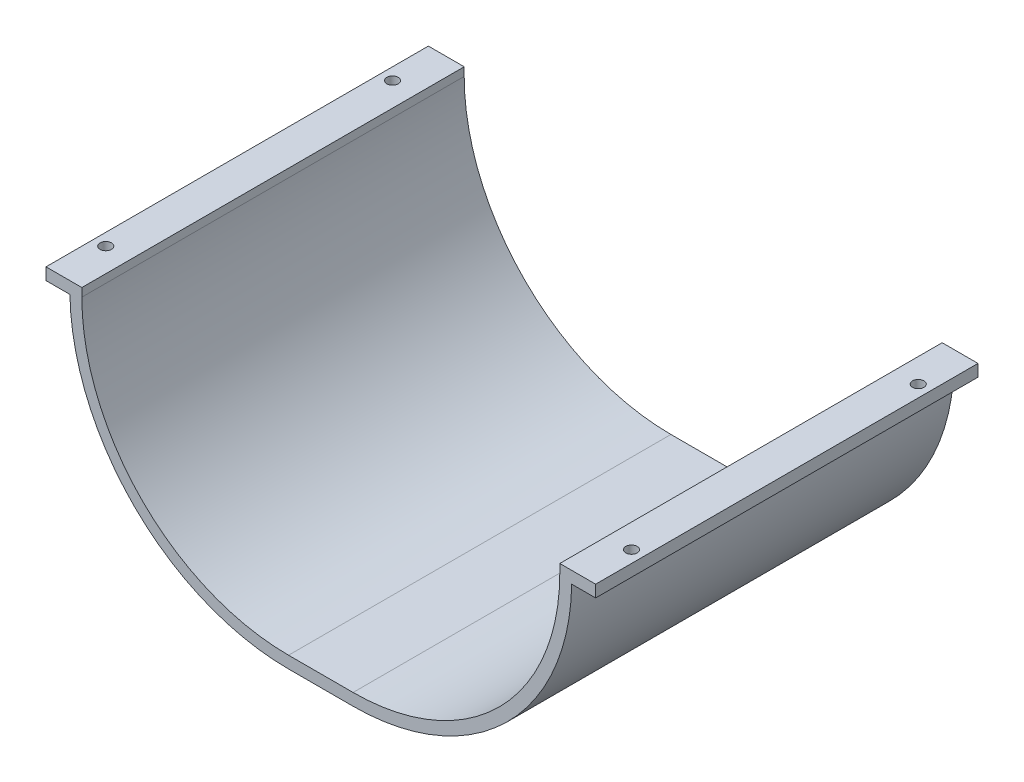
ISO-10303-21;
HEADER;
FILE_DESCRIPTION(('STEP AP214'),'2;1');
FILE_NAME('part.step','',(''),(''),'','','');
FILE_SCHEMA(('AUTOMOTIVE_DESIGN { 1 0 10303 214 1 1 1 1 }'));
ENDSEC;
DATA;
#1=APPLICATION_CONTEXT('core data for automotive mechanical design processes');
#2=APPLICATION_PROTOCOL_DEFINITION('international standard','automotive_design',2000,#1);
#3=PRODUCT_CONTEXT('',#1,'mechanical');
#4=PRODUCT('Part','Part','',(#3));
#5=PRODUCT_RELATED_PRODUCT_CATEGORY('part','',(#4));
#6=PRODUCT_DEFINITION_FORMATION('','',#4);
#7=PRODUCT_DEFINITION_CONTEXT('part definition',#1,'design');
#8=PRODUCT_DEFINITION('design','',#6,#7);
#9=PRODUCT_DEFINITION_SHAPE('','',#8);
#10=(LENGTH_UNIT() NAMED_UNIT(*) SI_UNIT(.MILLI.,.METRE.));
#11=(NAMED_UNIT(*) PLANE_ANGLE_UNIT() SI_UNIT($,.RADIAN.));
#12=(NAMED_UNIT(*) SI_UNIT($,.STERADIAN.) SOLID_ANGLE_UNIT());
#13=UNCERTAINTY_MEASURE_WITH_UNIT(LENGTH_MEASURE(1.E-05),#10,'distance_accuracy_value','');
#14=(GEOMETRIC_REPRESENTATION_CONTEXT(3) GLOBAL_UNCERTAINTY_ASSIGNED_CONTEXT((#13)) GLOBAL_UNIT_ASSIGNED_CONTEXT((#10,
#11,#12)) REPRESENTATION_CONTEXT('',''));
#15=CARTESIAN_POINT('',(0.,0.,0.));
#16=DIRECTION('',(0.,0.,1.));
#17=DIRECTION('',(1.,0.,0.));
#18=AXIS2_PLACEMENT_3D('',#15,#16,#17);
#19=CARTESIAN_POINT('',(86.5,86.5,160.));
#20=DIRECTION('',(0.,0.,-1.));
#21=DIRECTION('',(-1.,0.,0.));
#22=AXIS2_PLACEMENT_3D('',#19,#20,#21);
#23=CYLINDRICAL_SURFACE('',#22,91.5);
#24=CARTESIAN_POINT('',(86.5,86.5,0.));
#25=DIRECTION('',(0.,0.,1.));
#26=DIRECTION('',(1.,0.,0.));
#27=AXIS2_PLACEMENT_3D('',#24,#25,#26);
#28=CIRCLE('',#27,91.5);
#29=CARTESIAN_POINT('',(86.5000000000006,-4.99999999999999,0.));
#30=VERTEX_POINT('',#29);
#31=CARTESIAN_POINT('',(-4.98770409186144,85.,0.));
#32=VERTEX_POINT('',#31);
#33=EDGE_CURVE('E226',#30,#32,#28,.F.);
#34=ORIENTED_EDGE('',*,*,#33,.F.);
#35=DIRECTION('',(0.,0.,-1.));
#36=VECTOR('',#35,1.);
#37=CARTESIAN_POINT('',(86.5000000000006,-4.99999999999999,160.));
#38=LINE('',#37,#36);
#39=CARTESIAN_POINT('',(86.5000000000006,-4.99999999999999,160.));
#40=VERTEX_POINT('',#39);
#41=EDGE_CURVE('E11',#40,#30,#38,.T.);
#42=ORIENTED_EDGE('',*,*,#41,.F.);
#43=CARTESIAN_POINT('',(86.5,86.5,160.));
#44=DIRECTION('',(0.,0.,1.));
#45=DIRECTION('',(1.,0.,0.));
#46=AXIS2_PLACEMENT_3D('',#43,#44,#45);
#47=CIRCLE('',#46,91.5);
#48=CARTESIAN_POINT('',(-4.98770409186144,85.,160.));
#49=VERTEX_POINT('',#48);
#50=EDGE_CURVE('E190',#40,#49,#47,.F.);
#51=ORIENTED_EDGE('',*,*,#50,.T.);
#52=DIRECTION('',(0.,0.,-1.));
#53=VECTOR('',#52,1.);
#54=CARTESIAN_POINT('',(-4.98770409186144,85.,160.));
#55=LINE('',#54,#53);
#56=EDGE_CURVE('E110',#49,#32,#55,.T.);
#57=ORIENTED_EDGE('',*,*,#56,.T.);
#58=EDGE_LOOP('',(#34,#42,#51,#57));
#59=FACE_BOUND('',#58,.T.);
#60=ADVANCED_FACE('F40',(#59),#23,.T.);
#61=CARTESIAN_POINT('',(0.,-5.00000000000001,160.));
#62=DIRECTION('',(0.,1.,0.));
#63=DIRECTION('',(-1.,0.,0.));
#64=AXIS2_PLACEMENT_3D('',#61,#62,#63);
#65=PLANE('',#64);
#66=DIRECTION('',(1.,0.,0.));
#67=VECTOR('',#66,1.);
#68=CARTESIAN_POINT('',(0.,-5.00000000000001,0.));
#69=LINE('',#68,#67);
#70=CARTESIAN_POINT('',(113.499999999999,-4.99999999999999,0.));
#71=VERTEX_POINT('',#70);
#72=EDGE_CURVE('E229',#30,#71,#69,.T.);
#73=ORIENTED_EDGE('',*,*,#72,.T.);
#74=DIRECTION('',(0.,0.,-1.));
#75=VECTOR('',#74,1.);
#76=CARTESIAN_POINT('',(113.499999999999,-4.99999999999999,160.));
#77=LINE('',#76,#75);
#78=CARTESIAN_POINT('',(113.499999999999,-4.99999999999999,160.));
#79=VERTEX_POINT('',#78);
#80=EDGE_CURVE('E49',#79,#71,#77,.T.);
#81=ORIENTED_EDGE('',*,*,#80,.F.);
#82=DIRECTION('',(1.,0.,0.));
#83=VECTOR('',#82,1.);
#84=CARTESIAN_POINT('',(0.,-5.00000000000001,160.));
#85=LINE('',#84,#83);
#86=EDGE_CURVE('E188',#40,#79,#85,.T.);
#87=ORIENTED_EDGE('',*,*,#86,.F.);
#88=ORIENTED_EDGE('',*,*,#41,.T.);
#89=EDGE_LOOP('',(#73,#81,#87,#88));
#90=FACE_BOUND('',#89,.T.);
#91=ADVANCED_FACE('F331',(#90),#65,.F.);
#92=CARTESIAN_POINT('',(113.5,86.5,160.));
#93=DIRECTION('',(0.,0.,-1.));
#94=DIRECTION('',(-1.,0.,0.));
#95=AXIS2_PLACEMENT_3D('',#92,#93,#94);
#96=CYLINDRICAL_SURFACE('',#95,91.5);
#97=CARTESIAN_POINT('',(113.5,86.5,0.));
#98=DIRECTION('',(0.,0.,1.));
#99=DIRECTION('',(1.,0.,0.));
#100=AXIS2_PLACEMENT_3D('',#97,#98,#99);
#101=CIRCLE('',#100,91.5);
#102=CARTESIAN_POINT('',(204.987704091861,85.,0.));
#103=VERTEX_POINT('',#102);
#104=EDGE_CURVE('E231',#71,#103,#101,.T.);
#105=ORIENTED_EDGE('',*,*,#104,.T.);
#106=DIRECTION('',(0.,0.,-1.));
#107=VECTOR('',#106,1.);
#108=CARTESIAN_POINT('',(204.987704091861,85.,160.));
#109=LINE('',#108,#107);
#110=CARTESIAN_POINT('',(204.987704091861,85.,160.));
#111=VERTEX_POINT('',#110);
#112=EDGE_CURVE('E280',#111,#103,#109,.T.);
#113=ORIENTED_EDGE('',*,*,#112,.F.);
#114=CARTESIAN_POINT('',(113.5,86.5,160.));
#115=DIRECTION('',(0.,0.,1.));
#116=DIRECTION('',(1.,0.,0.));
#117=AXIS2_PLACEMENT_3D('',#114,#115,#116);
#118=CIRCLE('',#117,91.5);
#119=EDGE_CURVE('E184',#79,#111,#118,.T.);
#120=ORIENTED_EDGE('',*,*,#119,.F.);
#121=ORIENTED_EDGE('',*,*,#80,.T.);
#122=EDGE_LOOP('',(#105,#113,#120,#121));
#123=FACE_BOUND('',#122,.T.);
#124=ADVANCED_FACE('F335',(#123),#96,.T.);
#125=CARTESIAN_POINT('',(0.,85.,160.));
#126=DIRECTION('',(0.,-1.,0.));
#127=DIRECTION('',(0.,0.,-1.));
#128=AXIS2_PLACEMENT_3D('',#125,#126,#127);
#129=PLANE('',#128);
#130=CARTESIAN_POINT('',(209.993852045931,85.,140.));
#131=DIRECTION('',(0.,-1.,0.));
#132=DIRECTION('',(0.,0.,-1.));
#133=AXIS2_PLACEMENT_3D('',#130,#131,#132);
#134=CIRCLE('',#133,2.38125);
#135=CARTESIAN_POINT('',(209.993852045931,85.,137.61875));
#136=VERTEX_POINT('',#135);
#137=EDGE_CURVE('E204',#136,#136,#134,.T.);
#138=ORIENTED_EDGE('',*,*,#137,.F.);
#139=EDGE_LOOP('',(#138));
#140=FACE_BOUND('',#139,.T.);
#141=CARTESIAN_POINT('',(209.993852045931,85.,20.));
#142=DIRECTION('',(0.,-1.,0.));
#143=DIRECTION('',(0.,0.,-1.));
#144=AXIS2_PLACEMENT_3D('',#141,#142,#143);
#145=CIRCLE('',#144,2.38125000000001);
#146=CARTESIAN_POINT('',(209.993852045931,85.,17.61875));
#147=VERTEX_POINT('',#146);
#148=EDGE_CURVE('E207',#147,#147,#145,.T.);
#149=ORIENTED_EDGE('',*,*,#148,.F.);
#150=EDGE_LOOP('',(#149));
#151=FACE_BOUND('',#150,.T.);
#152=DIRECTION('',(-1.,0.,0.));
#153=VECTOR('',#152,1.);
#154=CARTESIAN_POINT('',(0.,85.,0.));
#155=LINE('',#154,#153);
#156=CARTESIAN_POINT('',(215.,85.,0.));
#157=VERTEX_POINT('',#156);
#158=EDGE_CURVE('E238',#157,#103,#155,.T.);
#159=ORIENTED_EDGE('',*,*,#158,.F.);
#160=DIRECTION('',(0.,0.,-1.));
#161=VECTOR('',#160,1.);
#162=CARTESIAN_POINT('',(215.,85.,160.));
#163=LINE('',#162,#161);
#164=CARTESIAN_POINT('',(215.,85.,160.));
#165=VERTEX_POINT('',#164);
#166=EDGE_CURVE('E278',#165,#157,#163,.T.);
#167=ORIENTED_EDGE('',*,*,#166,.F.);
#168=DIRECTION('',(-1.,0.,0.));
#169=VECTOR('',#168,1.);
#170=CARTESIAN_POINT('',(0.,85.,160.));
#171=LINE('',#170,#169);
#172=EDGE_CURVE('E180',#165,#111,#171,.T.);
#173=ORIENTED_EDGE('',*,*,#172,.T.);
#174=ORIENTED_EDGE('',*,*,#112,.T.);
#175=EDGE_LOOP('',(#159,#167,#173,#174));
#176=FACE_BOUND('',#175,.T.);
#177=ADVANCED_FACE('F340',(#140,#151,#176),#129,.T.);
#178=CARTESIAN_POINT('',(215.,0.,160.));
#179=DIRECTION('',(1.,0.,0.));
#180=DIRECTION('',(0.,0.,-1.));
#181=AXIS2_PLACEMENT_3D('',#178,#179,#180);
#182=PLANE('',#181);
#183=DIRECTION('',(0.,-1.,0.));
#184=VECTOR('',#183,1.);
#185=CARTESIAN_POINT('',(215.,0.,0.));
#186=LINE('',#185,#184);
#187=CARTESIAN_POINT('',(215.,90.,0.));
#188=VERTEX_POINT('',#187);
#189=EDGE_CURVE('E241',#188,#157,#186,.T.);
#190=ORIENTED_EDGE('',*,*,#189,.F.);
#191=DIRECTION('',(0.,0.,-1.));
#192=VECTOR('',#191,1.);
#193=CARTESIAN_POINT('',(215.,90.,160.));
#194=LINE('',#193,#192);
#195=CARTESIAN_POINT('',(215.,90.,160.));
#196=VERTEX_POINT('',#195);
#197=EDGE_CURVE('E276',#196,#188,#194,.T.);
#198=ORIENTED_EDGE('',*,*,#197,.F.);
#199=DIRECTION('',(0.,-1.,0.));
#200=VECTOR('',#199,1.);
#201=CARTESIAN_POINT('',(215.,0.,160.));
#202=LINE('',#201,#200);
#203=EDGE_CURVE('E174',#196,#165,#202,.T.);
#204=ORIENTED_EDGE('',*,*,#203,.T.);
#205=ORIENTED_EDGE('',*,*,#166,.T.);
#206=EDGE_LOOP('',(#190,#198,#204,#205));
#207=FACE_BOUND('',#206,.T.);
#208=ADVANCED_FACE('F292',(#207),#182,.T.);
#209=CARTESIAN_POINT('',(0.,90.,160.));
#210=DIRECTION('',(0.,1.,0.));
#211=DIRECTION('',(0.,0.,1.));
#212=AXIS2_PLACEMENT_3D('',#209,#210,#211);
#213=PLANE('',#212);
#214=CARTESIAN_POINT('',(209.993852045931,90.,140.));
#215=DIRECTION('',(0.,1.,0.));
#216=DIRECTION('',(0.,0.,1.));
#217=AXIS2_PLACEMENT_3D('',#214,#215,#216);
#218=CIRCLE('',#217,2.38125);
#219=CARTESIAN_POINT('',(209.993852045931,90.,142.38125));
#220=VERTEX_POINT('',#219);
#221=EDGE_CURVE('E43',#220,#220,#218,.T.);
#222=ORIENTED_EDGE('',*,*,#221,.F.);
#223=EDGE_LOOP('',(#222));
#224=FACE_BOUND('',#223,.T.);
#225=CARTESIAN_POINT('',(209.993852045931,90.,20.));
#226=DIRECTION('',(0.,1.,0.));
#227=DIRECTION('',(0.,0.,1.));
#228=AXIS2_PLACEMENT_3D('',#225,#226,#227);
#229=CIRCLE('',#228,2.38125000000001);
#230=CARTESIAN_POINT('',(209.993852045931,90.,22.38125));
#231=VERTEX_POINT('',#230);
#232=EDGE_CURVE('E196',#231,#231,#229,.T.);
#233=ORIENTED_EDGE('',*,*,#232,.F.);
#234=EDGE_LOOP('',(#233));
#235=FACE_BOUND('',#234,.T.);
#236=DIRECTION('',(1.,0.,0.));
#237=VECTOR('',#236,1.);
#238=CARTESIAN_POINT('',(0.,90.,0.));
#239=LINE('',#238,#237);
#240=CARTESIAN_POINT('',(200.,90.,0.));
#241=VERTEX_POINT('',#240);
#242=EDGE_CURVE('E244',#241,#188,#239,.T.);
#243=ORIENTED_EDGE('',*,*,#242,.F.);
#244=DIRECTION('',(0.,0.,-1.));
#245=VECTOR('',#244,1.);
#246=CARTESIAN_POINT('',(200.,90.,160.));
#247=LINE('',#246,#245);
#248=CARTESIAN_POINT('',(200.,90.,160.));
#249=VERTEX_POINT('',#248);
#250=EDGE_CURVE('E274',#249,#241,#247,.T.);
#251=ORIENTED_EDGE('',*,*,#250,.F.);
#252=DIRECTION('',(1.,0.,0.));
#253=VECTOR('',#252,1.);
#254=CARTESIAN_POINT('',(0.,90.,160.));
#255=LINE('',#254,#253);
#256=EDGE_CURVE('E167',#249,#196,#255,.T.);
#257=ORIENTED_EDGE('',*,*,#256,.T.);
#258=ORIENTED_EDGE('',*,*,#197,.T.);
#259=EDGE_LOOP('',(#243,#251,#257,#258));
#260=FACE_BOUND('',#259,.T.);
#261=ADVANCED_FACE('F289',(#224,#235,#260),#213,.T.);
#262=CARTESIAN_POINT('',(200.,0.,160.));
#263=DIRECTION('',(-1.,0.,0.));
#264=DIRECTION('',(0.,0.,1.));
#265=AXIS2_PLACEMENT_3D('',#262,#263,#264);
#266=PLANE('',#265);
#267=DIRECTION('',(0.,1.,0.));
#268=VECTOR('',#267,1.);
#269=CARTESIAN_POINT('',(200.,0.,0.));
#270=LINE('',#269,#268);
#271=CARTESIAN_POINT('',(200.,86.5000000000006,0.));
#272=VERTEX_POINT('',#271);
#273=EDGE_CURVE('E247',#272,#241,#270,.T.);
#274=ORIENTED_EDGE('',*,*,#273,.F.);
#275=DIRECTION('',(0.,0.,-1.));
#276=VECTOR('',#275,1.);
#277=CARTESIAN_POINT('',(200.,86.5000000000006,160.));
#278=LINE('',#277,#276);
#279=CARTESIAN_POINT('',(200.,86.5000000000006,160.));
#280=VERTEX_POINT('',#279);
#281=EDGE_CURVE('E272',#280,#272,#278,.T.);
#282=ORIENTED_EDGE('',*,*,#281,.F.);
#283=DIRECTION('',(0.,1.,0.));
#284=VECTOR('',#283,1.);
#285=CARTESIAN_POINT('',(200.,0.,160.));
#286=LINE('',#285,#284);
#287=EDGE_CURVE('E173',#280,#249,#286,.T.);
#288=ORIENTED_EDGE('',*,*,#287,.T.);
#289=ORIENTED_EDGE('',*,*,#250,.T.);
#290=EDGE_LOOP('',(#274,#282,#288,#289));
#291=FACE_BOUND('',#290,.T.);
#292=ADVANCED_FACE('F291',(#291),#266,.T.);
#293=CARTESIAN_POINT('',(113.5,86.5,160.));
#294=DIRECTION('',(0.,0.,-1.));
#295=DIRECTION('',(-1.,0.,0.));
#296=AXIS2_PLACEMENT_3D('',#293,#294,#295);
#297=CYLINDRICAL_SURFACE('',#296,86.5);
#298=CARTESIAN_POINT('',(113.5,86.5,0.));
#299=DIRECTION('',(0.,0.,1.));
#300=DIRECTION('',(1.,0.,0.));
#301=AXIS2_PLACEMENT_3D('',#298,#299,#300);
#302=CIRCLE('',#301,86.5);
#303=CARTESIAN_POINT('',(113.499999999999,0.,0.));
#304=VERTEX_POINT('',#303);
#305=EDGE_CURVE('E250',#304,#272,#302,.T.);
#306=ORIENTED_EDGE('',*,*,#305,.F.);
#307=DIRECTION('',(0.,0.,-1.));
#308=VECTOR('',#307,1.);
#309=CARTESIAN_POINT('',(113.499999999999,0.,160.));
#310=LINE('',#309,#308);
#311=CARTESIAN_POINT('',(113.499999999999,0.,160.));
#312=VERTEX_POINT('',#311);
#313=EDGE_CURVE('E270',#312,#304,#310,.T.);
#314=ORIENTED_EDGE('',*,*,#313,.F.);
#315=CARTESIAN_POINT('',(113.5,86.5,160.));
#316=DIRECTION('',(0.,0.,1.));
#317=DIRECTION('',(1.,0.,0.));
#318=AXIS2_PLACEMENT_3D('',#315,#316,#317);
#319=CIRCLE('',#318,86.5);
#320=EDGE_CURVE('E178',#312,#280,#319,.T.);
#321=ORIENTED_EDGE('',*,*,#320,.T.);
#322=ORIENTED_EDGE('',*,*,#281,.T.);
#323=EDGE_LOOP('',(#306,#314,#321,#322));
#324=FACE_BOUND('',#323,.T.);
#325=ADVANCED_FACE('F306',(#324),#297,.F.);
#326=CARTESIAN_POINT('',(0.,0.,160.));
#327=DIRECTION('',(0.,1.,0.));
#328=DIRECTION('',(-1.,0.,0.));
#329=AXIS2_PLACEMENT_3D('',#326,#327,#328);
#330=PLANE('',#329);
#331=DIRECTION('',(1.,0.,0.));
#332=VECTOR('',#331,1.);
#333=CARTESIAN_POINT('',(0.,0.,0.));
#334=LINE('',#333,#332);
#335=CARTESIAN_POINT('',(86.5000000000006,0.,0.));
#336=VERTEX_POINT('',#335);
#337=EDGE_CURVE('E253',#336,#304,#334,.T.);
#338=ORIENTED_EDGE('',*,*,#337,.F.);
#339=DIRECTION('',(0.,0.,-1.));
#340=VECTOR('',#339,1.);
#341=CARTESIAN_POINT('',(86.5000000000006,0.,160.));
#342=LINE('',#341,#340);
#343=CARTESIAN_POINT('',(86.5000000000006,0.,160.));
#344=VERTEX_POINT('',#343);
#345=EDGE_CURVE('E268',#344,#336,#342,.T.);
#346=ORIENTED_EDGE('',*,*,#345,.F.);
#347=DIRECTION('',(1.,0.,0.));
#348=VECTOR('',#347,1.);
#349=CARTESIAN_POINT('',(0.,0.,160.));
#350=LINE('',#349,#348);
#351=EDGE_CURVE('E307',#344,#312,#350,.T.);
#352=ORIENTED_EDGE('',*,*,#351,.T.);
#353=ORIENTED_EDGE('',*,*,#313,.T.);
#354=EDGE_LOOP('',(#338,#346,#352,#353));
#355=FACE_BOUND('',#354,.T.);
#356=ADVANCED_FACE('F321',(#355),#330,.T.);
#357=CARTESIAN_POINT('',(86.5,86.5,160.));
#358=DIRECTION('',(0.,0.,-1.));
#359=DIRECTION('',(-1.,0.,0.));
#360=AXIS2_PLACEMENT_3D('',#357,#358,#359);
#361=CYLINDRICAL_SURFACE('',#360,86.5);
#362=CARTESIAN_POINT('',(86.5,86.5,0.));
#363=DIRECTION('',(0.,0.,1.));
#364=DIRECTION('',(1.,0.,0.));
#365=AXIS2_PLACEMENT_3D('',#362,#363,#364);
#366=CIRCLE('',#365,86.5);
#367=CARTESIAN_POINT('',(0.,86.5000000000006,0.));
#368=VERTEX_POINT('',#367);
#369=EDGE_CURVE('E256',#336,#368,#366,.F.);
#370=ORIENTED_EDGE('',*,*,#369,.T.);
#371=DIRECTION('',(0.,0.,-1.));
#372=VECTOR('',#371,1.);
#373=CARTESIAN_POINT('',(0.,86.5000000000006,160.));
#374=LINE('',#373,#372);
#375=CARTESIAN_POINT('',(0.,86.5000000000006,160.));
#376=VERTEX_POINT('',#375);
#377=EDGE_CURVE('E265',#376,#368,#374,.T.);
#378=ORIENTED_EDGE('',*,*,#377,.F.);
#379=CARTESIAN_POINT('',(86.5,86.5,160.));
#380=DIRECTION('',(0.,0.,1.));
#381=DIRECTION('',(1.,0.,0.));
#382=AXIS2_PLACEMENT_3D('',#379,#380,#381);
#383=CIRCLE('',#382,86.5);
#384=EDGE_CURVE('E168',#344,#376,#383,.F.);
#385=ORIENTED_EDGE('',*,*,#384,.F.);
#386=ORIENTED_EDGE('',*,*,#345,.T.);
#387=EDGE_LOOP('',(#370,#378,#385,#386));
#388=FACE_BOUND('',#387,.T.);
#389=ADVANCED_FACE('F314',(#388),#361,.F.);
#390=CARTESIAN_POINT('',(0.,0.,160.));
#391=DIRECTION('',(-1.,0.,0.));
#392=DIRECTION('',(0.,0.,1.));
#393=AXIS2_PLACEMENT_3D('',#390,#391,#392);
#394=PLANE('',#393);
#395=DIRECTION('',(0.,1.,0.));
#396=VECTOR('',#395,1.);
#397=CARTESIAN_POINT('',(0.,0.,0.));
#398=LINE('',#397,#396);
#399=CARTESIAN_POINT('',(0.,90.,0.));
#400=VERTEX_POINT('',#399);
#401=EDGE_CURVE('E258',#368,#400,#398,.T.);
#402=ORIENTED_EDGE('',*,*,#401,.T.);
#403=DIRECTION('',(0.,0.,-1.));
#404=VECTOR('',#403,1.);
#405=CARTESIAN_POINT('',(0.,90.,160.));
#406=LINE('',#405,#404);
#407=CARTESIAN_POINT('',(0.,90.,160.));
#408=VERTEX_POINT('',#407);
#409=EDGE_CURVE('E156',#408,#400,#406,.T.);
#410=ORIENTED_EDGE('',*,*,#409,.F.);
#411=DIRECTION('',(0.,1.,0.));
#412=VECTOR('',#411,1.);
#413=CARTESIAN_POINT('',(0.,0.,160.));
#414=LINE('',#413,#412);
#415=EDGE_CURVE('E164',#376,#408,#414,.T.);
#416=ORIENTED_EDGE('',*,*,#415,.F.);
#417=ORIENTED_EDGE('',*,*,#377,.T.);
#418=EDGE_LOOP('',(#402,#410,#416,#417));
#419=FACE_BOUND('',#418,.T.);
#420=ADVANCED_FACE('F318',(#419),#394,.F.);
#421=CARTESIAN_POINT('',(-9.99385204593072,90.,20.));
#422=DIRECTION('',(0.,1.,0.));
#423=DIRECTION('',(0.,0.,1.));
#424=AXIS2_PLACEMENT_3D('',#421,#422,#423);
#425=CIRCLE('',#424,2.38125);
#426=CARTESIAN_POINT('',(-9.99385204593072,90.,22.38125));
#427=VERTEX_POINT('',#426);
#428=EDGE_CURVE('E193',#427,#427,#425,.T.);
#429=ORIENTED_EDGE('',*,*,#428,.F.);
#430=EDGE_LOOP('',(#429));
#431=FACE_BOUND('',#430,.T.);
#432=CARTESIAN_POINT('',(-9.99385204593072,90.,140.));
#433=DIRECTION('',(0.,1.,0.));
#434=DIRECTION('',(0.,0.,1.));
#435=AXIS2_PLACEMENT_3D('',#432,#433,#434);
#436=CIRCLE('',#435,2.38125);
#437=CARTESIAN_POINT('',(-9.99385204593072,90.,142.38125));
#438=VERTEX_POINT('',#437);
#439=EDGE_CURVE('E197',#438,#438,#436,.T.);
#440=ORIENTED_EDGE('',*,*,#439,.F.);
#441=EDGE_LOOP('',(#440));
#442=FACE_BOUND('',#441,.T.);
#443=CARTESIAN_POINT('',(-15.,90.,0.));
#444=VERTEX_POINT('',#443);
#445=EDGE_CURVE('E155',#444,#400,#239,.T.);
#446=ORIENTED_EDGE('',*,*,#445,.F.);
#447=DIRECTION('',(0.,0.,-1.));
#448=VECTOR('',#447,1.);
#449=CARTESIAN_POINT('',(-15.,90.,160.));
#450=LINE('',#449,#448);
#451=CARTESIAN_POINT('',(-15.,90.,160.));
#452=VERTEX_POINT('',#451);
#453=EDGE_CURVE('E149',#452,#444,#450,.T.);
#454=ORIENTED_EDGE('',*,*,#453,.F.);
#455=EDGE_CURVE('E153',#452,#408,#255,.T.);
#456=ORIENTED_EDGE('',*,*,#455,.T.);
#457=ORIENTED_EDGE('',*,*,#409,.T.);
#458=EDGE_LOOP('',(#446,#454,#456,#457));
#459=FACE_BOUND('',#458,.T.);
#460=ADVANCED_FACE('F151',(#431,#442,#459),#213,.T.);
#461=CARTESIAN_POINT('',(-15.,0.,160.));
#462=DIRECTION('',(1.,0.,0.));
#463=DIRECTION('',(0.,0.,-1.));
#464=AXIS2_PLACEMENT_3D('',#461,#462,#463);
#465=PLANE('',#464);
#466=DIRECTION('',(0.,-1.,0.));
#467=VECTOR('',#466,1.);
#468=CARTESIAN_POINT('',(-15.,0.,0.));
#469=LINE('',#468,#467);
#470=CARTESIAN_POINT('',(-15.,85.,0.));
#471=VERTEX_POINT('',#470);
#472=EDGE_CURVE('E103',#444,#471,#469,.T.);
#473=ORIENTED_EDGE('',*,*,#472,.T.);
#474=DIRECTION('',(0.,0.,-1.));
#475=VECTOR('',#474,1.);
#476=CARTESIAN_POINT('',(-15.,85.,160.));
#477=LINE('',#476,#475);
#478=CARTESIAN_POINT('',(-15.,85.,160.));
#479=VERTEX_POINT('',#478);
#480=EDGE_CURVE('E157',#479,#471,#477,.T.);
#481=ORIENTED_EDGE('',*,*,#480,.F.);
#482=DIRECTION('',(0.,-1.,0.));
#483=VECTOR('',#482,1.);
#484=CARTESIAN_POINT('',(-15.,0.,160.));
#485=LINE('',#484,#483);
#486=EDGE_CURVE('E159',#452,#479,#485,.T.);
#487=ORIENTED_EDGE('',*,*,#486,.F.);
#488=ORIENTED_EDGE('',*,*,#453,.T.);
#489=EDGE_LOOP('',(#473,#481,#487,#488));
#490=FACE_BOUND('',#489,.T.);
#491=ADVANCED_FACE('F160',(#490),#465,.F.);
#492=CARTESIAN_POINT('',(0.,85.,160.));
#493=DIRECTION('',(0.,1.,0.));
#494=DIRECTION('',(0.,0.,1.));
#495=AXIS2_PLACEMENT_3D('',#492,#493,#494);
#496=PLANE('',#495);
#497=CARTESIAN_POINT('',(-9.99385204593072,85.,20.));
#498=DIRECTION('',(0.,-1.,0.));
#499=DIRECTION('',(0.,0.,-1.));
#500=AXIS2_PLACEMENT_3D('',#497,#498,#499);
#501=CIRCLE('',#500,2.38125);
#502=CARTESIAN_POINT('',(-9.99385204593072,85.,17.61875));
#503=VERTEX_POINT('',#502);
#504=EDGE_CURVE('E203',#503,#503,#501,.T.);
#505=ORIENTED_EDGE('',*,*,#504,.F.);
#506=EDGE_LOOP('',(#505));
#507=FACE_BOUND('',#506,.T.);
#508=CARTESIAN_POINT('',(-9.99385204593072,85.,140.));
#509=DIRECTION('',(0.,-1.,0.));
#510=DIRECTION('',(0.,0.,-1.));
#511=AXIS2_PLACEMENT_3D('',#508,#509,#510);
#512=CIRCLE('',#511,2.38125);
#513=CARTESIAN_POINT('',(-9.99385204593072,85.,137.61875));
#514=VERTEX_POINT('',#513);
#515=EDGE_CURVE('E200',#514,#514,#512,.T.);
#516=ORIENTED_EDGE('',*,*,#515,.F.);
#517=EDGE_LOOP('',(#516));
#518=FACE_BOUND('',#517,.T.);
#519=DIRECTION('',(1.,0.,0.));
#520=VECTOR('',#519,1.);
#521=CARTESIAN_POINT('',(0.,85.,0.));
#522=LINE('',#521,#520);
#523=EDGE_CURVE('E192',#471,#32,#522,.T.);
#524=ORIENTED_EDGE('',*,*,#523,.T.);
#525=ORIENTED_EDGE('',*,*,#56,.F.);
#526=DIRECTION('',(1.,0.,0.));
#527=VECTOR('',#526,1.);
#528=CARTESIAN_POINT('',(0.,85.,160.));
#529=LINE('',#528,#527);
#530=EDGE_CURVE('E58',#479,#49,#529,.T.);
#531=ORIENTED_EDGE('',*,*,#530,.F.);
#532=ORIENTED_EDGE('',*,*,#480,.T.);
#533=EDGE_LOOP('',(#524,#525,#531,#532));
#534=FACE_BOUND('',#533,.T.);
#535=ADVANCED_FACE('F215',(#507,#518,#534),#496,.F.);
#536=CARTESIAN_POINT('',(0.,0.,160.));
#537=DIRECTION('',(0.,0.,1.));
#538=DIRECTION('',(1.,0.,0.));
#539=AXIS2_PLACEMENT_3D('',#536,#537,#538);
#540=PLANE('',#539);
#541=ORIENTED_EDGE('',*,*,#50,.F.);
#542=ORIENTED_EDGE('',*,*,#86,.T.);
#543=ORIENTED_EDGE('',*,*,#119,.T.);
#544=ORIENTED_EDGE('',*,*,#172,.F.);
#545=ORIENTED_EDGE('',*,*,#203,.F.);
#546=ORIENTED_EDGE('',*,*,#256,.F.);
#547=ORIENTED_EDGE('',*,*,#287,.F.);
#548=ORIENTED_EDGE('',*,*,#320,.F.);
#549=ORIENTED_EDGE('',*,*,#351,.F.);
#550=ORIENTED_EDGE('',*,*,#384,.T.);
#551=ORIENTED_EDGE('',*,*,#415,.T.);
#552=ORIENTED_EDGE('',*,*,#455,.F.);
#553=ORIENTED_EDGE('',*,*,#486,.T.);
#554=ORIENTED_EDGE('',*,*,#530,.T.);
#555=EDGE_LOOP('',(#541,#542,#543,#544,#545,#546,#547,#548,#549,#550,#551,#552,#553,#554));
#556=FACE_BOUND('',#555,.T.);
#557=ADVANCED_FACE('F162',(#556),#540,.T.);
#558=CARTESIAN_POINT('',(0.,0.,0.));
#559=DIRECTION('',(0.,0.,1.));
#560=DIRECTION('',(1.,0.,0.));
#561=AXIS2_PLACEMENT_3D('',#558,#559,#560);
#562=PLANE('',#561);
#563=ORIENTED_EDGE('',*,*,#33,.T.);
#564=ORIENTED_EDGE('',*,*,#523,.F.);
#565=ORIENTED_EDGE('',*,*,#472,.F.);
#566=ORIENTED_EDGE('',*,*,#445,.T.);
#567=ORIENTED_EDGE('',*,*,#401,.F.);
#568=ORIENTED_EDGE('',*,*,#369,.F.);
#569=ORIENTED_EDGE('',*,*,#337,.T.);
#570=ORIENTED_EDGE('',*,*,#305,.T.);
#571=ORIENTED_EDGE('',*,*,#273,.T.);
#572=ORIENTED_EDGE('',*,*,#242,.T.);
#573=ORIENTED_EDGE('',*,*,#189,.T.);
#574=ORIENTED_EDGE('',*,*,#158,.T.);
#575=ORIENTED_EDGE('',*,*,#104,.F.);
#576=ORIENTED_EDGE('',*,*,#72,.F.);
#577=EDGE_LOOP('',(#563,#564,#565,#566,#567,#568,#569,#570,#571,#572,#573,#574,#575,#576));
#578=FACE_BOUND('',#577,.T.);
#579=ADVANCED_FACE('F227',(#578),#562,.F.);
#580=CARTESIAN_POINT('',(-9.99385204593072,245.,140.));
#581=DIRECTION('',(0.,-1.,0.));
#582=DIRECTION('',(0.,0.,-1.));
#583=AXIS2_PLACEMENT_3D('',#580,#581,#582);
#584=CYLINDRICAL_SURFACE('',#583,2.38125);
#585=ORIENTED_EDGE('',*,*,#439,.T.);
#586=EDGE_LOOP('',(#585));
#587=FACE_BOUND('',#586,.T.);
#588=ORIENTED_EDGE('',*,*,#515,.T.);
#589=EDGE_LOOP('',(#588));
#590=FACE_BOUND('',#589,.T.);
#591=ADVANCED_FACE('F409',(#587,#590),#584,.F.);
#592=CARTESIAN_POINT('',(-9.99385204593072,245.,20.));
#593=DIRECTION('',(0.,-1.,0.));
#594=DIRECTION('',(0.,0.,-1.));
#595=AXIS2_PLACEMENT_3D('',#592,#593,#594);
#596=CYLINDRICAL_SURFACE('',#595,2.38125);
#597=ORIENTED_EDGE('',*,*,#428,.T.);
#598=EDGE_LOOP('',(#597));
#599=FACE_BOUND('',#598,.T.);
#600=ORIENTED_EDGE('',*,*,#504,.T.);
#601=EDGE_LOOP('',(#600));
#602=FACE_BOUND('',#601,.T.);
#603=ADVANCED_FACE('F213',(#599,#602),#596,.F.);
#604=CARTESIAN_POINT('',(209.993852045931,245.,20.));
#605=DIRECTION('',(0.,-1.,0.));
#606=DIRECTION('',(0.,0.,-1.));
#607=AXIS2_PLACEMENT_3D('',#604,#605,#606);
#608=CYLINDRICAL_SURFACE('',#607,2.38125000000001);
#609=ORIENTED_EDGE('',*,*,#232,.T.);
#610=EDGE_LOOP('',(#609));
#611=FACE_BOUND('',#610,.T.);
#612=ORIENTED_EDGE('',*,*,#148,.T.);
#613=EDGE_LOOP('',(#612));
#614=FACE_BOUND('',#613,.T.);
#615=ADVANCED_FACE('F286',(#611,#614),#608,.F.);
#616=CARTESIAN_POINT('',(209.993852045931,245.,140.));
#617=DIRECTION('',(0.,-1.,0.));
#618=DIRECTION('',(0.,0.,-1.));
#619=AXIS2_PLACEMENT_3D('',#616,#617,#618);
#620=CYLINDRICAL_SURFACE('',#619,2.38125);
#621=ORIENTED_EDGE('',*,*,#221,.T.);
#622=EDGE_LOOP('',(#621));
#623=FACE_BOUND('',#622,.T.);
#624=ORIENTED_EDGE('',*,*,#137,.T.);
#625=EDGE_LOOP('',(#624));
#626=FACE_BOUND('',#625,.T.);
#627=ADVANCED_FACE('F378',(#623,#626),#620,.F.);
#628=CLOSED_SHELL('',(#60,#91,#124,#177,#208,#261,#292,#325,#356,#389,#420,#460,#491,#535,#557,
#579,#591,#603,#615,#627));
#629=MANIFOLD_SOLID_BREP('B2',#628);
#630=ADVANCED_BREP_SHAPE_REPRESENTATION('',(#18,#629),#14);
#631=SHAPE_DEFINITION_REPRESENTATION(#9,#630);
ENDSEC;
END-ISO-10303-21;
